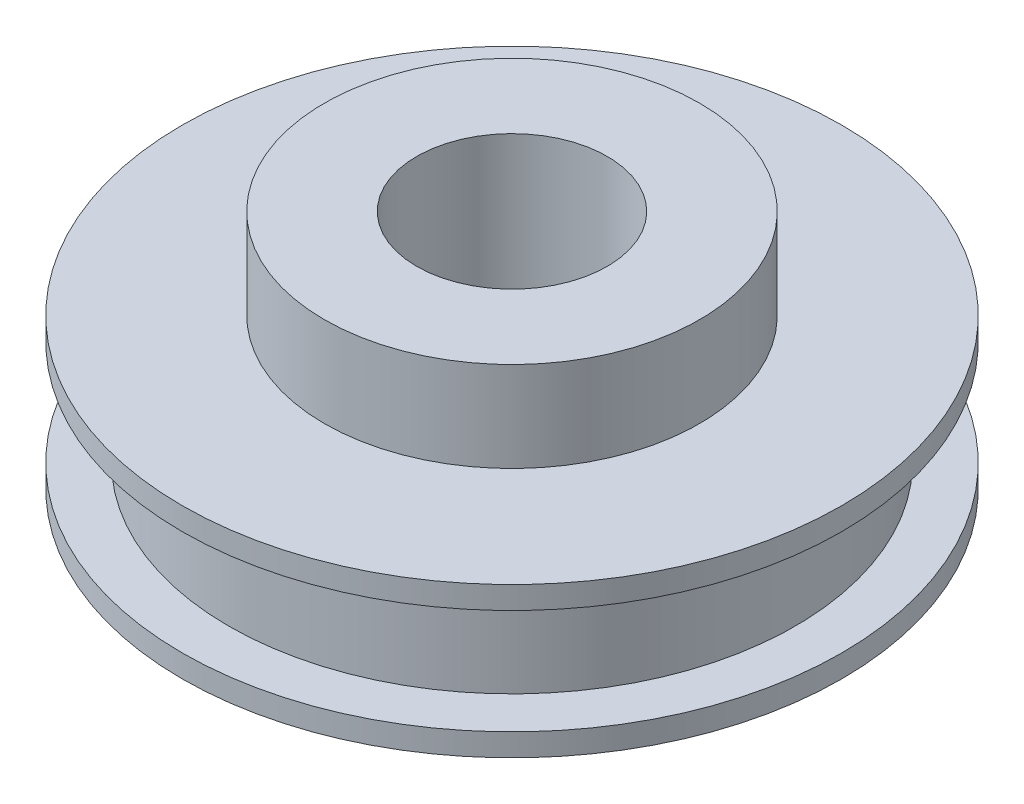
ISO-10303-21;
HEADER;
FILE_DESCRIPTION(('STEP AP214'),'2;1');
FILE_NAME('part.step','',(''),(''),'','','');
FILE_SCHEMA(('AUTOMOTIVE_DESIGN { 1 0 10303 214 1 1 1 1 }'));
ENDSEC;
DATA;
#1=APPLICATION_CONTEXT('core data for automotive mechanical design processes');
#2=APPLICATION_PROTOCOL_DEFINITION('international standard','automotive_design',2000,#1);
#3=PRODUCT_CONTEXT('',#1,'mechanical');
#4=PRODUCT('Part','Part','',(#3));
#5=PRODUCT_RELATED_PRODUCT_CATEGORY('part','',(#4));
#6=PRODUCT_DEFINITION_FORMATION('','',#4);
#7=PRODUCT_DEFINITION_CONTEXT('part definition',#1,'design');
#8=PRODUCT_DEFINITION('design','',#6,#7);
#9=PRODUCT_DEFINITION_SHAPE('','',#8);
#10=(LENGTH_UNIT() NAMED_UNIT(*) SI_UNIT(.MILLI.,.METRE.));
#11=(NAMED_UNIT(*) PLANE_ANGLE_UNIT() SI_UNIT($,.RADIAN.));
#12=(NAMED_UNIT(*) SI_UNIT($,.STERADIAN.) SOLID_ANGLE_UNIT());
#13=UNCERTAINTY_MEASURE_WITH_UNIT(LENGTH_MEASURE(1.E-05),#10,'distance_accuracy_value','');
#14=(GEOMETRIC_REPRESENTATION_CONTEXT(3) GLOBAL_UNCERTAINTY_ASSIGNED_CONTEXT((#13)) GLOBAL_UNIT_ASSIGNED_CONTEXT((#10,
#11,#12)) REPRESENTATION_CONTEXT('',''));
#15=CARTESIAN_POINT('',(0.,0.,0.));
#16=DIRECTION('',(0.,0.,1.));
#17=DIRECTION('',(1.,0.,0.));
#18=AXIS2_PLACEMENT_3D('',#15,#16,#17);
#19=CARTESIAN_POINT('',(-21.971,0.,0.));
#20=DIRECTION('',(0.,1.,0.));
#21=DIRECTION('',(0.,0.,1.));
#22=AXIS2_PLACEMENT_3D('',#19,#20,#21);
#23=PLANE('',#22);
#24=CARTESIAN_POINT('',(0.,0.,0.));
#25=DIRECTION('',(0.,1.,0.));
#26=DIRECTION('',(0.,0.,1.));
#27=AXIS2_PLACEMENT_3D('',#24,#25,#26);
#28=CIRCLE('',#27,6.35);
#29=CARTESIAN_POINT('',(0.,0.,6.35));
#30=VERTEX_POINT('',#29);
#31=EDGE_CURVE('E64',#30,#30,#28,.T.);
#32=ORIENTED_EDGE('',*,*,#31,.T.);
#33=EDGE_LOOP('',(#32));
#34=FACE_BOUND('',#33,.T.);
#35=CARTESIAN_POINT('',(0.,0.,0.));
#36=DIRECTION('',(0.,-1.,0.));
#37=DIRECTION('',(0.,0.,-1.));
#38=AXIS2_PLACEMENT_3D('',#35,#36,#37);
#39=CIRCLE('',#38,21.971);
#40=CARTESIAN_POINT('',(0.,0.,-21.971));
#41=VERTEX_POINT('',#40);
#42=EDGE_CURVE('E61',#41,#41,#39,.T.);
#43=ORIENTED_EDGE('',*,*,#42,.T.);
#44=EDGE_LOOP('',(#43));
#45=FACE_BOUND('',#44,.T.);
#46=ADVANCED_FACE('F33',(#34,#45),#23,.F.);
#47=CARTESIAN_POINT('',(0.,16.,0.));
#48=DIRECTION('',(0.,-1.,0.));
#49=DIRECTION('',(0.,0.,-1.));
#50=AXIS2_PLACEMENT_3D('',#47,#48,#49);
#51=PLANE('',#50);
#52=CARTESIAN_POINT('',(0.,16.,0.));
#53=DIRECTION('',(0.,1.,0.));
#54=DIRECTION('',(0.,0.,1.));
#55=AXIS2_PLACEMENT_3D('',#52,#53,#54);
#56=CIRCLE('',#55,6.35);
#57=CARTESIAN_POINT('',(0.,16.,6.35));
#58=VERTEX_POINT('',#57);
#59=EDGE_CURVE('E65',#58,#58,#56,.T.);
#60=ORIENTED_EDGE('',*,*,#59,.F.);
#61=EDGE_LOOP('',(#60));
#62=FACE_BOUND('',#61,.T.);
#63=CARTESIAN_POINT('',(0.,16.,0.));
#64=DIRECTION('',(0.,-1.,0.));
#65=DIRECTION('',(0.,0.,-1.));
#66=AXIS2_PLACEMENT_3D('',#63,#64,#65);
#67=CIRCLE('',#66,12.5);
#68=CARTESIAN_POINT('',(0.,16.,-12.5));
#69=VERTEX_POINT('',#68);
#70=EDGE_CURVE('E10',#69,#69,#67,.T.);
#71=ORIENTED_EDGE('',*,*,#70,.F.);
#72=EDGE_LOOP('',(#71));
#73=FACE_BOUND('',#72,.T.);
#74=ADVANCED_FACE('F80',(#62,#73),#51,.F.);
#75=CARTESIAN_POINT('',(0.,0.,0.));
#76=DIRECTION('',(0.,-1.,0.));
#77=DIRECTION('',(0.,0.,-1.));
#78=AXIS2_PLACEMENT_3D('',#75,#76,#77);
#79=CYLINDRICAL_SURFACE('',#78,12.5);
#80=CARTESIAN_POINT('',(0.,10.,0.));
#81=DIRECTION('',(0.,-1.,0.));
#82=DIRECTION('',(0.,0.,-1.));
#83=AXIS2_PLACEMENT_3D('',#80,#81,#82);
#84=CIRCLE('',#83,12.5);
#85=CARTESIAN_POINT('',(0.,10.,-12.5));
#86=VERTEX_POINT('',#85);
#87=EDGE_CURVE('E39',#86,#86,#84,.T.);
#88=ORIENTED_EDGE('',*,*,#87,.F.);
#89=EDGE_LOOP('',(#88));
#90=FACE_BOUND('',#89,.T.);
#91=ORIENTED_EDGE('',*,*,#70,.T.);
#92=EDGE_LOOP('',(#91));
#93=FACE_BOUND('',#92,.T.);
#94=ADVANCED_FACE('F83',(#90,#93),#79,.T.);
#95=CARTESIAN_POINT('',(-12.5,10.,0.));
#96=DIRECTION('',(0.,-1.,0.));
#97=DIRECTION('',(0.,0.,-1.));
#98=AXIS2_PLACEMENT_3D('',#95,#96,#97);
#99=PLANE('',#98);
#100=CARTESIAN_POINT('',(0.,10.,0.));
#101=DIRECTION('',(0.,-1.,0.));
#102=DIRECTION('',(0.,0.,-1.));
#103=AXIS2_PLACEMENT_3D('',#100,#101,#102);
#104=CIRCLE('',#103,21.971);
#105=CARTESIAN_POINT('',(0.,10.,-21.971));
#106=VERTEX_POINT('',#105);
#107=EDGE_CURVE('E43',#106,#106,#104,.T.);
#108=ORIENTED_EDGE('',*,*,#107,.F.);
#109=EDGE_LOOP('',(#108));
#110=FACE_BOUND('',#109,.T.);
#111=ORIENTED_EDGE('',*,*,#87,.T.);
#112=EDGE_LOOP('',(#111));
#113=FACE_BOUND('',#112,.T.);
#114=ADVANCED_FACE('F88',(#110,#113),#99,.F.);
#115=CARTESIAN_POINT('',(0.,0.,0.));
#116=DIRECTION('',(0.,-1.,0.));
#117=DIRECTION('',(0.,0.,-1.));
#118=AXIS2_PLACEMENT_3D('',#115,#116,#117);
#119=CYLINDRICAL_SURFACE('',#118,21.971);
#120=CARTESIAN_POINT('',(0.,8.5,0.));
#121=DIRECTION('',(0.,-1.,0.));
#122=DIRECTION('',(0.,0.,-1.));
#123=AXIS2_PLACEMENT_3D('',#120,#121,#122);
#124=CIRCLE('',#123,21.971);
#125=CARTESIAN_POINT('',(0.,8.5,-21.971));
#126=VERTEX_POINT('',#125);
#127=EDGE_CURVE('E47',#126,#126,#124,.T.);
#128=ORIENTED_EDGE('',*,*,#127,.F.);
#129=EDGE_LOOP('',(#128));
#130=FACE_BOUND('',#129,.T.);
#131=ORIENTED_EDGE('',*,*,#107,.T.);
#132=EDGE_LOOP('',(#131));
#133=FACE_BOUND('',#132,.T.);
#134=ADVANCED_FACE('F94',(#130,#133),#119,.T.);
#135=CARTESIAN_POINT('',(-21.971,8.5,0.));
#136=DIRECTION('',(0.,1.,0.));
#137=DIRECTION('',(0.,0.,1.));
#138=AXIS2_PLACEMENT_3D('',#135,#136,#137);
#139=PLANE('',#138);
#140=CARTESIAN_POINT('',(0.,8.5,0.));
#141=DIRECTION('',(0.,-1.,0.));
#142=DIRECTION('',(0.,0.,-1.));
#143=AXIS2_PLACEMENT_3D('',#140,#141,#142);
#144=CIRCLE('',#143,18.875);
#145=CARTESIAN_POINT('',(0.,8.5,-18.875));
#146=VERTEX_POINT('',#145);
#147=EDGE_CURVE('E52',#146,#146,#144,.T.);
#148=ORIENTED_EDGE('',*,*,#147,.F.);
#149=EDGE_LOOP('',(#148));
#150=FACE_BOUND('',#149,.T.);
#151=ORIENTED_EDGE('',*,*,#127,.T.);
#152=EDGE_LOOP('',(#151));
#153=FACE_BOUND('',#152,.T.);
#154=ADVANCED_FACE('F98',(#150,#153),#139,.F.);
#155=CARTESIAN_POINT('',(0.,0.,0.));
#156=DIRECTION('',(0.,-1.,0.));
#157=DIRECTION('',(0.,0.,-1.));
#158=AXIS2_PLACEMENT_3D('',#155,#156,#157);
#159=CYLINDRICAL_SURFACE('',#158,18.875);
#160=CARTESIAN_POINT('',(0.,1.5,0.));
#161=DIRECTION('',(0.,-1.,0.));
#162=DIRECTION('',(0.,0.,-1.));
#163=AXIS2_PLACEMENT_3D('',#160,#161,#162);
#164=CIRCLE('',#163,18.875);
#165=CARTESIAN_POINT('',(0.,1.5,-18.875));
#166=VERTEX_POINT('',#165);
#167=EDGE_CURVE('E55',#166,#166,#164,.T.);
#168=ORIENTED_EDGE('',*,*,#167,.F.);
#169=EDGE_LOOP('',(#168));
#170=FACE_BOUND('',#169,.T.);
#171=ORIENTED_EDGE('',*,*,#147,.T.);
#172=EDGE_LOOP('',(#171));
#173=FACE_BOUND('',#172,.T.);
#174=ADVANCED_FACE('F102',(#170,#173),#159,.T.);
#175=CARTESIAN_POINT('',(-18.875,1.5,0.));
#176=DIRECTION('',(0.,-1.,0.));
#177=DIRECTION('',(0.,0.,-1.));
#178=AXIS2_PLACEMENT_3D('',#175,#176,#177);
#179=PLANE('',#178);
#180=CARTESIAN_POINT('',(0.,1.5,0.));
#181=DIRECTION('',(0.,-1.,0.));
#182=DIRECTION('',(0.,0.,-1.));
#183=AXIS2_PLACEMENT_3D('',#180,#181,#182);
#184=CIRCLE('',#183,21.971);
#185=CARTESIAN_POINT('',(0.,1.5,-21.971));
#186=VERTEX_POINT('',#185);
#187=EDGE_CURVE('E58',#186,#186,#184,.T.);
#188=ORIENTED_EDGE('',*,*,#187,.F.);
#189=EDGE_LOOP('',(#188));
#190=FACE_BOUND('',#189,.T.);
#191=ORIENTED_EDGE('',*,*,#167,.T.);
#192=EDGE_LOOP('',(#191));
#193=FACE_BOUND('',#192,.T.);
#194=ADVANCED_FACE('F106',(#190,#193),#179,.F.);
#195=CARTESIAN_POINT('',(0.,0.,0.));
#196=DIRECTION('',(0.,-1.,0.));
#197=DIRECTION('',(0.,0.,-1.));
#198=AXIS2_PLACEMENT_3D('',#195,#196,#197);
#199=CYLINDRICAL_SURFACE('',#198,21.971);
#200=ORIENTED_EDGE('',*,*,#42,.F.);
#201=EDGE_LOOP('',(#200));
#202=FACE_BOUND('',#201,.T.);
#203=ORIENTED_EDGE('',*,*,#187,.T.);
#204=EDGE_LOOP('',(#203));
#205=FACE_BOUND('',#204,.T.);
#206=ADVANCED_FACE('F76',(#202,#205),#199,.T.);
#207=CARTESIAN_POINT('',(0.,0.,0.));
#208=DIRECTION('',(0.,1.,0.));
#209=DIRECTION('',(0.,0.,1.));
#210=AXIS2_PLACEMENT_3D('',#207,#208,#209);
#211=CYLINDRICAL_SURFACE('',#210,6.35);
#212=ORIENTED_EDGE('',*,*,#31,.F.);
#213=EDGE_LOOP('',(#212));
#214=FACE_BOUND('',#213,.T.);
#215=ORIENTED_EDGE('',*,*,#59,.T.);
#216=EDGE_LOOP('',(#215));
#217=FACE_BOUND('',#216,.T.);
#218=ADVANCED_FACE('F73',(#214,#217),#211,.F.);
#219=CLOSED_SHELL('',(#46,#74,#94,#114,#134,#154,#174,#194,#206,#218));
#220=MANIFOLD_SOLID_BREP('B2',#219);
#221=ADVANCED_BREP_SHAPE_REPRESENTATION('',(#18,#220),#14);
#222=SHAPE_DEFINITION_REPRESENTATION(#9,#221);
ENDSEC;
END-ISO-10303-21;
